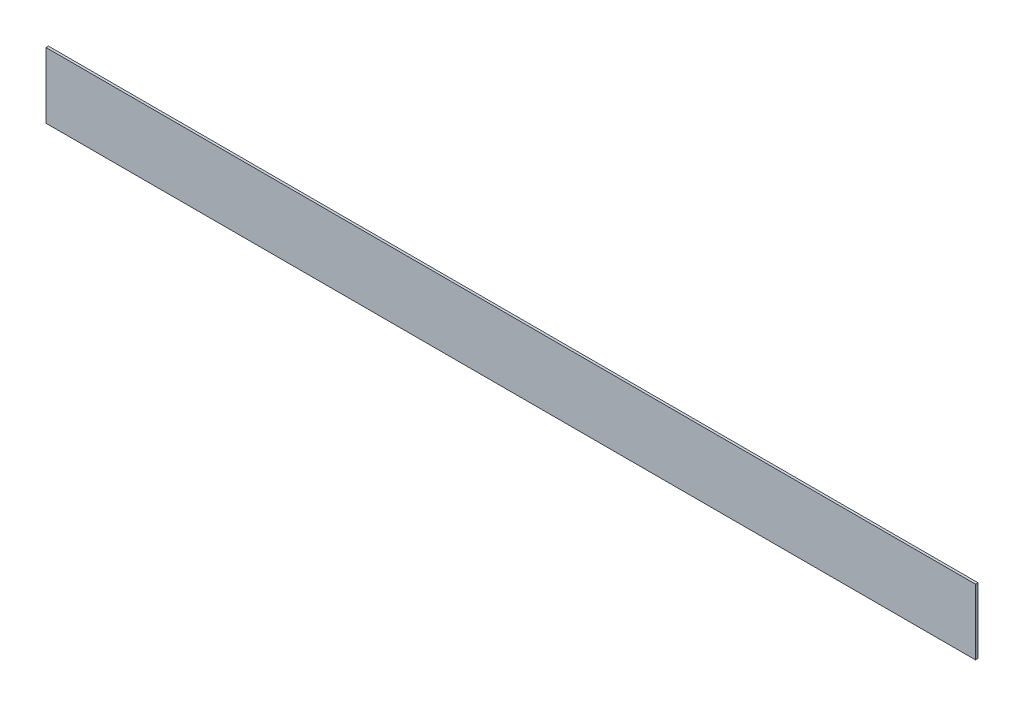
ISO-10303-21;
HEADER;
FILE_DESCRIPTION(('STEP AP214'),'2;1');
FILE_NAME('part.step','',(''),(''),'','','');
FILE_SCHEMA(('AUTOMOTIVE_DESIGN { 1 0 10303 214 1 1 1 1 }'));
ENDSEC;
DATA;
#1=APPLICATION_CONTEXT('core data for automotive mechanical design processes');
#2=APPLICATION_PROTOCOL_DEFINITION('international standard','automotive_design',2000,#1);
#3=PRODUCT_CONTEXT('',#1,'mechanical');
#4=PRODUCT('Part','Part','',(#3));
#5=PRODUCT_RELATED_PRODUCT_CATEGORY('part','',(#4));
#6=PRODUCT_DEFINITION_FORMATION('','',#4);
#7=PRODUCT_DEFINITION_CONTEXT('part definition',#1,'design');
#8=PRODUCT_DEFINITION('design','',#6,#7);
#9=PRODUCT_DEFINITION_SHAPE('','',#8);
#10=(LENGTH_UNIT() NAMED_UNIT(*) SI_UNIT(.MILLI.,.METRE.));
#11=(NAMED_UNIT(*) PLANE_ANGLE_UNIT() SI_UNIT($,.RADIAN.));
#12=(NAMED_UNIT(*) SI_UNIT($,.STERADIAN.) SOLID_ANGLE_UNIT());
#13=UNCERTAINTY_MEASURE_WITH_UNIT(LENGTH_MEASURE(1.E-05),#10,'distance_accuracy_value','');
#14=(GEOMETRIC_REPRESENTATION_CONTEXT(3) GLOBAL_UNCERTAINTY_ASSIGNED_CONTEXT((#13)) GLOBAL_UNIT_ASSIGNED_CONTEXT((#10,
#11,#12)) REPRESENTATION_CONTEXT('',''));
#15=CARTESIAN_POINT('',(0.,0.,0.));
#16=DIRECTION('',(0.,0.,1.));
#17=DIRECTION('',(1.,0.,0.));
#18=AXIS2_PLACEMENT_3D('',#15,#16,#17);
#19=CARTESIAN_POINT('',(-637.998350515464,732.61855670103,4.));
#20=DIRECTION('',(1.,0.,0.));
#21=DIRECTION('',(0.,1.,0.));
#22=AXIS2_PLACEMENT_3D('',#19,#20,#21);
#23=PLANE('',#22);
#24=DIRECTION('',(0.,-1.,0.));
#25=VECTOR('',#24,1.);
#26=CARTESIAN_POINT('',(-637.998350515464,732.61855670103,0.));
#27=LINE('',#26,#25);
#28=CARTESIAN_POINT('',(-637.998350515464,732.61855670103,0.));
#29=VERTEX_POINT('',#28);
#30=CARTESIAN_POINT('',(-637.998350515464,626.47855670103,0.));
#31=VERTEX_POINT('',#30);
#32=EDGE_CURVE('E96',#29,#31,#27,.T.);
#33=ORIENTED_EDGE('',*,*,#32,.T.);
#34=DIRECTION('',(0.,0.,-1.));
#35=VECTOR('',#34,1.);
#36=CARTESIAN_POINT('',(-637.998350515464,626.47855670103,4.));
#37=LINE('',#36,#35);
#38=CARTESIAN_POINT('',(-637.998350515464,626.47855670103,4.));
#39=VERTEX_POINT('',#38);
#40=EDGE_CURVE('E11',#39,#31,#37,.T.);
#41=ORIENTED_EDGE('',*,*,#40,.F.);
#42=DIRECTION('',(0.,-1.,0.));
#43=VECTOR('',#42,1.);
#44=CARTESIAN_POINT('',(-637.998350515464,732.61855670103,4.));
#45=LINE('',#44,#43);
#46=CARTESIAN_POINT('',(-637.998350515464,732.61855670103,4.));
#47=VERTEX_POINT('',#46);
#48=EDGE_CURVE('E84',#47,#39,#45,.T.);
#49=ORIENTED_EDGE('',*,*,#48,.F.);
#50=DIRECTION('',(0.,0.,-1.));
#51=VECTOR('',#50,1.);
#52=CARTESIAN_POINT('',(-637.998350515464,732.61855670103,4.));
#53=LINE('',#52,#51);
#54=EDGE_CURVE('E92',#47,#29,#53,.T.);
#55=ORIENTED_EDGE('',*,*,#54,.T.);
#56=EDGE_LOOP('',(#33,#41,#49,#55));
#57=FACE_BOUND('',#56,.T.);
#58=ADVANCED_FACE('F33',(#57),#23,.F.);
#59=CARTESIAN_POINT('',(-637.998350515464,626.47855670103,4.));
#60=DIRECTION('',(0.,1.,0.));
#61=DIRECTION('',(0.,0.,1.));
#62=AXIS2_PLACEMENT_3D('',#59,#60,#61);
#63=PLANE('',#62);
#64=DIRECTION('',(1.,0.,0.));
#65=VECTOR('',#64,1.);
#66=CARTESIAN_POINT('',(-637.998350515464,626.47855670103,0.));
#67=LINE('',#66,#65);
#68=CARTESIAN_POINT('',(866.001649484536,626.47855670103,0.));
#69=VERTEX_POINT('',#68);
#70=EDGE_CURVE('E88',#31,#69,#67,.T.);
#71=ORIENTED_EDGE('',*,*,#70,.T.);
#72=DIRECTION('',(0.,0.,-1.));
#73=VECTOR('',#72,1.);
#74=CARTESIAN_POINT('',(866.001649484536,626.47855670103,4.));
#75=LINE('',#74,#73);
#76=CARTESIAN_POINT('',(866.001649484536,626.47855670103,4.));
#77=VERTEX_POINT('',#76);
#78=EDGE_CURVE('E41',#77,#69,#75,.T.);
#79=ORIENTED_EDGE('',*,*,#78,.F.);
#80=DIRECTION('',(1.,0.,0.));
#81=VECTOR('',#80,1.);
#82=CARTESIAN_POINT('',(-637.998350515464,626.47855670103,4.));
#83=LINE('',#82,#81);
#84=EDGE_CURVE('E79',#39,#77,#83,.T.);
#85=ORIENTED_EDGE('',*,*,#84,.F.);
#86=ORIENTED_EDGE('',*,*,#40,.T.);
#87=EDGE_LOOP('',(#71,#79,#85,#86));
#88=FACE_BOUND('',#87,.T.);
#89=ADVANCED_FACE('F87',(#88),#63,.F.);
#90=CARTESIAN_POINT('',(866.001649484536,732.61855670103,4.));
#91=DIRECTION('',(-1.,0.,0.));
#92=DIRECTION('',(0.,0.,1.));
#93=AXIS2_PLACEMENT_3D('',#90,#91,#92);
#94=PLANE('',#93);
#95=DIRECTION('',(0.,1.,0.));
#96=VECTOR('',#95,1.);
#97=CARTESIAN_POINT('',(866.001649484536,732.61855670103,0.));
#98=LINE('',#97,#96);
#99=CARTESIAN_POINT('',(866.001649484536,732.61855670103,0.));
#100=VERTEX_POINT('',#99);
#101=EDGE_CURVE('E66',#69,#100,#98,.T.);
#102=ORIENTED_EDGE('',*,*,#101,.T.);
#103=DIRECTION('',(0.,0.,-1.));
#104=VECTOR('',#103,1.);
#105=CARTESIAN_POINT('',(866.001649484536,732.61855670103,4.));
#106=LINE('',#105,#104);
#107=CARTESIAN_POINT('',(866.001649484536,732.61855670103,4.));
#108=VERTEX_POINT('',#107);
#109=EDGE_CURVE('E89',#108,#100,#106,.T.);
#110=ORIENTED_EDGE('',*,*,#109,.F.);
#111=DIRECTION('',(0.,1.,0.));
#112=VECTOR('',#111,1.);
#113=CARTESIAN_POINT('',(866.001649484536,732.61855670103,4.));
#114=LINE('',#113,#112);
#115=EDGE_CURVE('E82',#77,#108,#114,.T.);
#116=ORIENTED_EDGE('',*,*,#115,.F.);
#117=ORIENTED_EDGE('',*,*,#78,.T.);
#118=EDGE_LOOP('',(#102,#110,#116,#117));
#119=FACE_BOUND('',#118,.T.);
#120=ADVANCED_FACE('F90',(#119),#94,.F.);
#121=CARTESIAN_POINT('',(-637.998350515464,732.61855670103,4.));
#122=DIRECTION('',(0.,-1.,0.));
#123=DIRECTION('',(0.,0.,-1.));
#124=AXIS2_PLACEMENT_3D('',#121,#122,#123);
#125=PLANE('',#124);
#126=DIRECTION('',(-1.,0.,0.));
#127=VECTOR('',#126,1.);
#128=CARTESIAN_POINT('',(-637.998350515464,732.61855670103,0.));
#129=LINE('',#128,#127);
#130=EDGE_CURVE('E72',#100,#29,#129,.T.);
#131=ORIENTED_EDGE('',*,*,#130,.T.);
#132=ORIENTED_EDGE('',*,*,#54,.F.);
#133=DIRECTION('',(-1.,0.,0.));
#134=VECTOR('',#133,1.);
#135=CARTESIAN_POINT('',(-637.998350515464,732.61855670103,4.));
#136=LINE('',#135,#134);
#137=EDGE_CURVE('E49',#108,#47,#136,.T.);
#138=ORIENTED_EDGE('',*,*,#137,.F.);
#139=ORIENTED_EDGE('',*,*,#109,.T.);
#140=EDGE_LOOP('',(#131,#132,#138,#139));
#141=FACE_BOUND('',#140,.T.);
#142=ADVANCED_FACE('F103',(#141),#125,.F.);
#143=CARTESIAN_POINT('',(0.,0.,4.));
#144=DIRECTION('',(0.,0.,1.));
#145=DIRECTION('',(1.,0.,0.));
#146=AXIS2_PLACEMENT_3D('',#143,#144,#145);
#147=PLANE('',#146);
#148=ORIENTED_EDGE('',*,*,#48,.T.);
#149=ORIENTED_EDGE('',*,*,#84,.T.);
#150=ORIENTED_EDGE('',*,*,#115,.T.);
#151=ORIENTED_EDGE('',*,*,#137,.T.);
#152=EDGE_LOOP('',(#148,#149,#150,#151));
#153=FACE_BOUND('',#152,.T.);
#154=ADVANCED_FACE('F80',(#153),#147,.T.);
#155=CARTESIAN_POINT('',(0.,0.,0.));
#156=DIRECTION('',(0.,0.,1.));
#157=DIRECTION('',(1.,0.,0.));
#158=AXIS2_PLACEMENT_3D('',#155,#156,#157);
#159=PLANE('',#158);
#160=ORIENTED_EDGE('',*,*,#32,.F.);
#161=ORIENTED_EDGE('',*,*,#130,.F.);
#162=ORIENTED_EDGE('',*,*,#101,.F.);
#163=ORIENTED_EDGE('',*,*,#70,.F.);
#164=EDGE_LOOP('',(#160,#161,#162,#163));
#165=FACE_BOUND('',#164,.T.);
#166=ADVANCED_FACE('F106',(#165),#159,.F.);
#167=CLOSED_SHELL('',(#58,#89,#120,#142,#154,#166));
#168=MANIFOLD_SOLID_BREP('B2',#167);
#169=ADVANCED_BREP_SHAPE_REPRESENTATION('',(#18,#168),#14);
#170=SHAPE_DEFINITION_REPRESENTATION(#9,#169);
ENDSEC;
END-ISO-10303-21;
